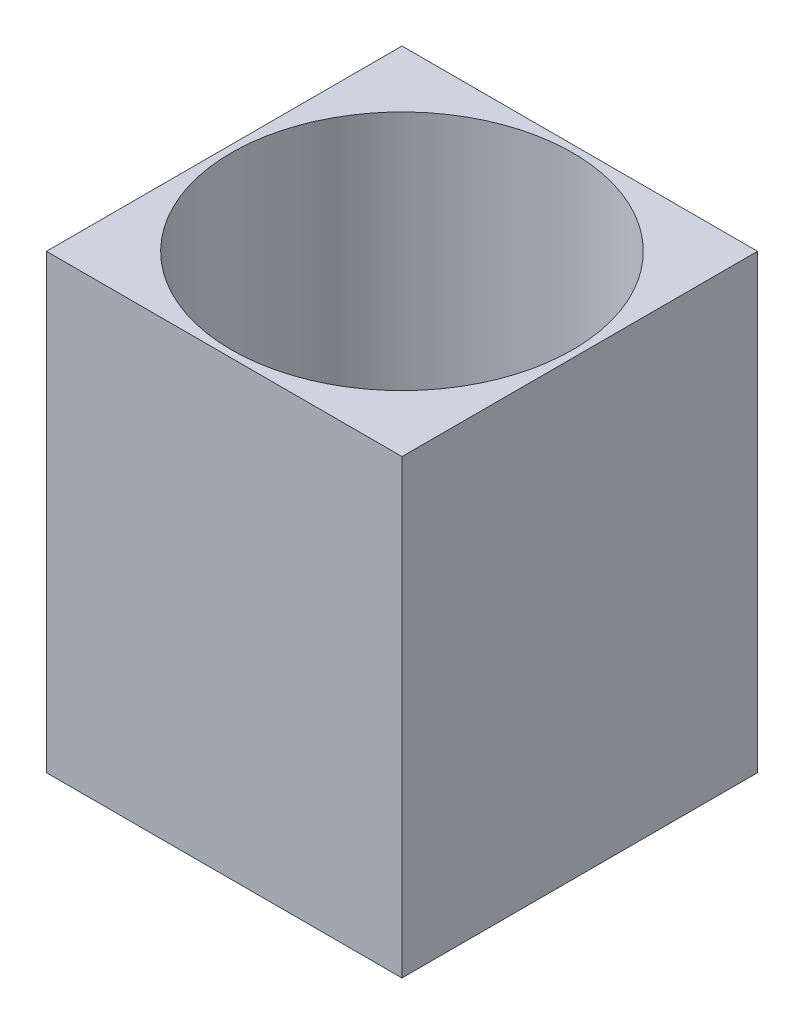
ISO-10303-21;
HEADER;
FILE_DESCRIPTION(('STEP AP214'),'2;1');
FILE_NAME('part.step','',(''),(''),'','','');
FILE_SCHEMA(('AUTOMOTIVE_DESIGN { 1 0 10303 214 1 1 1 1 }'));
ENDSEC;
DATA;
#1=APPLICATION_CONTEXT('core data for automotive mechanical design processes');
#2=APPLICATION_PROTOCOL_DEFINITION('international standard','automotive_design',2000,#1);
#3=PRODUCT_CONTEXT('',#1,'mechanical');
#4=PRODUCT('Part','Part','',(#3));
#5=PRODUCT_RELATED_PRODUCT_CATEGORY('part','',(#4));
#6=PRODUCT_DEFINITION_FORMATION('','',#4);
#7=PRODUCT_DEFINITION_CONTEXT('part definition',#1,'design');
#8=PRODUCT_DEFINITION('design','',#6,#7);
#9=PRODUCT_DEFINITION_SHAPE('','',#8);
#10=(LENGTH_UNIT() NAMED_UNIT(*) SI_UNIT(.MILLI.,.METRE.));
#11=(NAMED_UNIT(*) PLANE_ANGLE_UNIT() SI_UNIT($,.RADIAN.));
#12=(NAMED_UNIT(*) SI_UNIT($,.STERADIAN.) SOLID_ANGLE_UNIT());
#13=UNCERTAINTY_MEASURE_WITH_UNIT(LENGTH_MEASURE(1.E-05),#10,'distance_accuracy_value','');
#14=(GEOMETRIC_REPRESENTATION_CONTEXT(3) GLOBAL_UNCERTAINTY_ASSIGNED_CONTEXT((#13)) GLOBAL_UNIT_ASSIGNED_CONTEXT((#10,
#11,#12)) REPRESENTATION_CONTEXT('',''));
#15=CARTESIAN_POINT('',(0.,0.,0.));
#16=DIRECTION('',(0.,0.,1.));
#17=DIRECTION('',(1.,0.,0.));
#18=AXIS2_PLACEMENT_3D('',#15,#16,#17);
#19=CARTESIAN_POINT('',(0.,6.35,0.));
#20=DIRECTION('',(0.,-1.,0.));
#21=DIRECTION('',(0.,0.,-1.));
#22=AXIS2_PLACEMENT_3D('',#19,#20,#21);
#23=PLANE('',#22);
#24=DIRECTION('',(0.,0.,1.));
#25=VECTOR('',#24,1.);
#26=CARTESIAN_POINT('',(0.,6.35,0.));
#27=LINE('',#26,#25);
#28=CARTESIAN_POINT('',(0.,6.35,-5.));
#29=VERTEX_POINT('',#28);
#30=CARTESIAN_POINT('',(0.,6.35,0.));
#31=VERTEX_POINT('',#30);
#32=EDGE_CURVE('E96',#29,#31,#27,.T.);
#33=ORIENTED_EDGE('',*,*,#32,.T.);
#34=DIRECTION('',(1.,0.,0.));
#35=VECTOR('',#34,1.);
#36=CARTESIAN_POINT('',(0.,6.35,0.));
#37=LINE('',#36,#35);
#38=CARTESIAN_POINT('',(5.,6.35,0.));
#39=VERTEX_POINT('',#38);
#40=EDGE_CURVE('E91',#31,#39,#37,.T.);
#41=ORIENTED_EDGE('',*,*,#40,.T.);
#42=DIRECTION('',(0.,0.,-1.));
#43=VECTOR('',#42,1.);
#44=CARTESIAN_POINT('',(5.,6.35,0.));
#45=LINE('',#44,#43);
#46=CARTESIAN_POINT('',(5.,6.35,-5.));
#47=VERTEX_POINT('',#46);
#48=EDGE_CURVE('E94',#39,#47,#45,.T.);
#49=ORIENTED_EDGE('',*,*,#48,.T.);
#50=DIRECTION('',(-1.,0.,0.));
#51=VECTOR('',#50,1.);
#52=CARTESIAN_POINT('',(0.,6.35,-5.));
#53=LINE('',#52,#51);
#54=EDGE_CURVE('E61',#47,#29,#53,.T.);
#55=ORIENTED_EDGE('',*,*,#54,.T.);
#56=EDGE_LOOP('',(#33,#41,#49,#55));
#57=FACE_BOUND('',#56,.T.);
#58=CARTESIAN_POINT('',(2.5,6.35,-2.5));
#59=DIRECTION('',(0.,1.,0.));
#60=DIRECTION('',(0.,0.,1.));
#61=AXIS2_PLACEMENT_3D('',#58,#59,#60);
#62=CIRCLE('',#61,2.4);
#63=CARTESIAN_POINT('',(2.5,6.35,-0.1));
#64=VERTEX_POINT('',#63);
#65=EDGE_CURVE('E116',#64,#64,#62,.T.);
#66=ORIENTED_EDGE('',*,*,#65,.F.);
#67=EDGE_LOOP('',(#66));
#68=FACE_BOUND('',#67,.T.);
#69=ADVANCED_FACE('F43',(#57,#68),#23,.F.);
#70=CARTESIAN_POINT('',(0.,0.,0.));
#71=DIRECTION('',(0.,-1.,0.));
#72=DIRECTION('',(0.,0.,-1.));
#73=AXIS2_PLACEMENT_3D('',#70,#71,#72);
#74=PLANE('',#73);
#75=DIRECTION('',(0.,0.,1.));
#76=VECTOR('',#75,1.);
#77=CARTESIAN_POINT('',(0.,0.,0.));
#78=LINE('',#77,#76);
#79=CARTESIAN_POINT('',(0.,0.,-5.));
#80=VERTEX_POINT('',#79);
#81=CARTESIAN_POINT('',(0.,0.,0.));
#82=VERTEX_POINT('',#81);
#83=EDGE_CURVE('E112',#80,#82,#78,.T.);
#84=ORIENTED_EDGE('',*,*,#83,.F.);
#85=DIRECTION('',(-1.,0.,0.));
#86=VECTOR('',#85,1.);
#87=CARTESIAN_POINT('',(0.,0.,-5.));
#88=LINE('',#87,#86);
#89=CARTESIAN_POINT('',(5.,0.,-5.));
#90=VERTEX_POINT('',#89);
#91=EDGE_CURVE('E84',#90,#80,#88,.T.);
#92=ORIENTED_EDGE('',*,*,#91,.F.);
#93=DIRECTION('',(0.,0.,-1.));
#94=VECTOR('',#93,1.);
#95=CARTESIAN_POINT('',(5.,0.,0.));
#96=LINE('',#95,#94);
#97=CARTESIAN_POINT('',(5.,0.,0.));
#98=VERTEX_POINT('',#97);
#99=EDGE_CURVE('E78',#98,#90,#96,.T.);
#100=ORIENTED_EDGE('',*,*,#99,.F.);
#101=DIRECTION('',(1.,0.,0.));
#102=VECTOR('',#101,1.);
#103=CARTESIAN_POINT('',(0.,0.,0.));
#104=LINE('',#103,#102);
#105=EDGE_CURVE('E101',#82,#98,#104,.T.);
#106=ORIENTED_EDGE('',*,*,#105,.F.);
#107=EDGE_LOOP('',(#84,#92,#100,#106));
#108=FACE_BOUND('',#107,.T.);
#109=CARTESIAN_POINT('',(2.5,0.,-2.5));
#110=DIRECTION('',(0.,1.,0.));
#111=DIRECTION('',(0.,0.,1.));
#112=AXIS2_PLACEMENT_3D('',#109,#110,#111);
#113=CIRCLE('',#112,2.4);
#114=CARTESIAN_POINT('',(2.5,0.,-0.1));
#115=VERTEX_POINT('',#114);
#116=EDGE_CURVE('E134',#115,#115,#113,.T.);
#117=ORIENTED_EDGE('',*,*,#116,.T.);
#118=EDGE_LOOP('',(#117));
#119=FACE_BOUND('',#118,.T.);
#120=ADVANCED_FACE('F129',(#108,#119),#74,.T.);
#121=CARTESIAN_POINT('',(0.,6.35,0.));
#122=DIRECTION('',(1.,0.,0.));
#123=DIRECTION('',(0.,0.,-1.));
#124=AXIS2_PLACEMENT_3D('',#121,#122,#123);
#125=PLANE('',#124);
#126=ORIENTED_EDGE('',*,*,#83,.T.);
#127=DIRECTION('',(0.,-1.,0.));
#128=VECTOR('',#127,1.);
#129=CARTESIAN_POINT('',(0.,6.35,0.));
#130=LINE('',#129,#128);
#131=EDGE_CURVE('E11',#31,#82,#130,.T.);
#132=ORIENTED_EDGE('',*,*,#131,.F.);
#133=ORIENTED_EDGE('',*,*,#32,.F.);
#134=DIRECTION('',(0.,-1.,0.));
#135=VECTOR('',#134,1.);
#136=CARTESIAN_POINT('',(0.,6.35,-5.));
#137=LINE('',#136,#135);
#138=EDGE_CURVE('E108',#29,#80,#137,.T.);
#139=ORIENTED_EDGE('',*,*,#138,.T.);
#140=EDGE_LOOP('',(#126,#132,#133,#139));
#141=FACE_BOUND('',#140,.T.);
#142=ADVANCED_FACE('F45',(#141),#125,.F.);
#143=CARTESIAN_POINT('',(0.,6.35,0.));
#144=DIRECTION('',(0.,0.,-1.));
#145=DIRECTION('',(-1.,0.,0.));
#146=AXIS2_PLACEMENT_3D('',#143,#144,#145);
#147=PLANE('',#146);
#148=ORIENTED_EDGE('',*,*,#105,.T.);
#149=DIRECTION('',(0.,-1.,0.));
#150=VECTOR('',#149,1.);
#151=CARTESIAN_POINT('',(5.,6.35,0.));
#152=LINE('',#151,#150);
#153=EDGE_CURVE('E53',#39,#98,#152,.T.);
#154=ORIENTED_EDGE('',*,*,#153,.F.);
#155=ORIENTED_EDGE('',*,*,#40,.F.);
#156=ORIENTED_EDGE('',*,*,#131,.T.);
#157=EDGE_LOOP('',(#148,#154,#155,#156));
#158=FACE_BOUND('',#157,.T.);
#159=ADVANCED_FACE('F100',(#158),#147,.F.);
#160=CARTESIAN_POINT('',(5.,6.35,0.));
#161=DIRECTION('',(-1.,0.,0.));
#162=DIRECTION('',(0.,0.,1.));
#163=AXIS2_PLACEMENT_3D('',#160,#161,#162);
#164=PLANE('',#163);
#165=ORIENTED_EDGE('',*,*,#99,.T.);
#166=DIRECTION('',(0.,-1.,0.));
#167=VECTOR('',#166,1.);
#168=CARTESIAN_POINT('',(5.,6.35,-5.));
#169=LINE('',#168,#167);
#170=EDGE_CURVE('E103',#47,#90,#169,.T.);
#171=ORIENTED_EDGE('',*,*,#170,.F.);
#172=ORIENTED_EDGE('',*,*,#48,.F.);
#173=ORIENTED_EDGE('',*,*,#153,.T.);
#174=EDGE_LOOP('',(#165,#171,#172,#173));
#175=FACE_BOUND('',#174,.T.);
#176=ADVANCED_FACE('F104',(#175),#164,.F.);
#177=CARTESIAN_POINT('',(0.,6.35,-5.));
#178=DIRECTION('',(0.,0.,1.));
#179=DIRECTION('',(1.,0.,0.));
#180=AXIS2_PLACEMENT_3D('',#177,#178,#179);
#181=PLANE('',#180);
#182=ORIENTED_EDGE('',*,*,#91,.T.);
#183=ORIENTED_EDGE('',*,*,#138,.F.);
#184=ORIENTED_EDGE('',*,*,#54,.F.);
#185=ORIENTED_EDGE('',*,*,#170,.T.);
#186=EDGE_LOOP('',(#182,#183,#184,#185));
#187=FACE_BOUND('',#186,.T.);
#188=ADVANCED_FACE('F126',(#187),#181,.F.);
#189=CARTESIAN_POINT('',(2.5,6.35,-2.5));
#190=DIRECTION('',(0.,-1.,0.));
#191=DIRECTION('',(0.,0.,-1.));
#192=AXIS2_PLACEMENT_3D('',#189,#190,#191);
#193=CYLINDRICAL_SURFACE('',#192,2.4);
#194=ORIENTED_EDGE('',*,*,#65,.T.);
#195=EDGE_LOOP('',(#194));
#196=FACE_BOUND('',#195,.T.);
#197=ORIENTED_EDGE('',*,*,#116,.F.);
#198=EDGE_LOOP('',(#197));
#199=FACE_BOUND('',#198,.T.);
#200=ADVANCED_FACE('F142',(#196,#199),#193,.F.);
#201=CLOSED_SHELL('',(#69,#120,#142,#159,#176,#188,#200));
#202=MANIFOLD_SOLID_BREP('B2',#201);
#203=ADVANCED_BREP_SHAPE_REPRESENTATION('',(#18,#202),#14);
#204=SHAPE_DEFINITION_REPRESENTATION(#9,#203);
ENDSEC;
END-ISO-10303-21;
